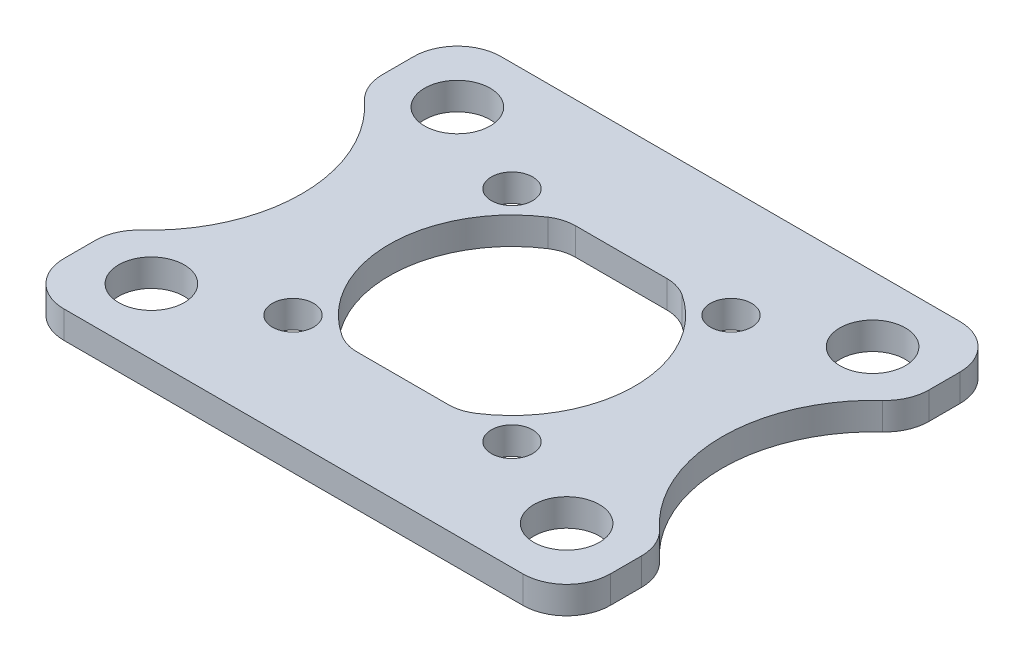
ISO-10303-21;
HEADER;
FILE_DESCRIPTION(('STEP AP214'),'2;1');
FILE_NAME('part.step','',(''),(''),'','','');
FILE_SCHEMA(('AUTOMOTIVE_DESIGN { 1 0 10303 214 1 1 1 1 }'));
ENDSEC;
DATA;
#1=APPLICATION_CONTEXT('core data for automotive mechanical design processes');
#2=APPLICATION_PROTOCOL_DEFINITION('international standard','automotive_design',2000,#1);
#3=PRODUCT_CONTEXT('',#1,'mechanical');
#4=PRODUCT('Part','Part','',(#3));
#5=PRODUCT_RELATED_PRODUCT_CATEGORY('part','',(#4));
#6=PRODUCT_DEFINITION_FORMATION('','',#4);
#7=PRODUCT_DEFINITION_CONTEXT('part definition',#1,'design');
#8=PRODUCT_DEFINITION('design','',#6,#7);
#9=PRODUCT_DEFINITION_SHAPE('','',#8);
#10=(LENGTH_UNIT() NAMED_UNIT(*) SI_UNIT(.MILLI.,.METRE.));
#11=(NAMED_UNIT(*) PLANE_ANGLE_UNIT() SI_UNIT($,.RADIAN.));
#12=(NAMED_UNIT(*) SI_UNIT($,.STERADIAN.) SOLID_ANGLE_UNIT());
#13=UNCERTAINTY_MEASURE_WITH_UNIT(LENGTH_MEASURE(1.E-05),#10,'distance_accuracy_value','');
#14=(GEOMETRIC_REPRESENTATION_CONTEXT(3) GLOBAL_UNCERTAINTY_ASSIGNED_CONTEXT((#13)) GLOBAL_UNIT_ASSIGNED_CONTEXT((#10,
#11,#12)) REPRESENTATION_CONTEXT('',''));
#15=CARTESIAN_POINT('',(0.,0.,0.));
#16=DIRECTION('',(0.,0.,1.));
#17=DIRECTION('',(1.,0.,0.));
#18=AXIS2_PLACEMENT_3D('',#15,#16,#17);
#19=CARTESIAN_POINT('',(15.875,1.5875,12.7));
#20=DIRECTION('',(-1.,0.,0.));
#21=DIRECTION('',(0.,0.,1.));
#22=AXIS2_PLACEMENT_3D('',#19,#20,#21);
#23=PLANE('',#22);
#24=DIRECTION('',(0.,0.,-1.));
#25=VECTOR('',#24,1.);
#26=CARTESIAN_POINT('',(15.875,0.,12.7));
#27=LINE('',#26,#25);
#28=CARTESIAN_POINT('',(15.875,0.,-8.35115536916897));
#29=VERTEX_POINT('',#28);
#30=CARTESIAN_POINT('',(15.875,0.,-10.16));
#31=VERTEX_POINT('',#30);
#32=EDGE_CURVE('E320',#29,#31,#27,.T.);
#33=ORIENTED_EDGE('',*,*,#32,.T.);
#34=DIRECTION('',(0.,-1.,0.));
#35=VECTOR('',#34,1.);
#36=CARTESIAN_POINT('',(15.875,1.5875,-10.16));
#37=LINE('',#36,#35);
#38=CARTESIAN_POINT('',(15.875,1.5875,-10.16));
#39=VERTEX_POINT('',#38);
#40=EDGE_CURVE('E369',#31,#39,#37,.F.);
#41=ORIENTED_EDGE('',*,*,#40,.T.);
#42=DIRECTION('',(0.,0.,-1.));
#43=VECTOR('',#42,1.);
#44=CARTESIAN_POINT('',(15.875,1.5875,12.7));
#45=LINE('',#44,#43);
#46=CARTESIAN_POINT('',(15.875,1.5875,-8.35115536916897));
#47=VERTEX_POINT('',#46);
#48=EDGE_CURVE('E301',#47,#39,#45,.T.);
#49=ORIENTED_EDGE('',*,*,#48,.F.);
#50=DIRECTION('',(0.,-1.,0.));
#51=VECTOR('',#50,1.);
#52=CARTESIAN_POINT('',(15.875,1.5875,-8.35115536916897));
#53=LINE('',#52,#51);
#54=EDGE_CURVE('E366',#47,#29,#53,.T.);
#55=ORIENTED_EDGE('',*,*,#54,.T.);
#56=EDGE_LOOP('',(#33,#41,#49,#55));
#57=FACE_BOUND('',#56,.T.);
#58=ADVANCED_FACE('F36',(#57),#23,.F.);
#59=CARTESIAN_POINT('',(-15.875,1.5875,12.7));
#60=DIRECTION('',(1.,0.,0.));
#61=DIRECTION('',(0.,0.,-1.));
#62=AXIS2_PLACEMENT_3D('',#59,#60,#61);
#63=PLANE('',#62);
#64=DIRECTION('',(0.,0.,1.));
#65=VECTOR('',#64,1.);
#66=CARTESIAN_POINT('',(-15.875,0.,12.7));
#67=LINE('',#66,#65);
#68=CARTESIAN_POINT('',(-15.875,0.,8.35115536916898));
#69=VERTEX_POINT('',#68);
#70=CARTESIAN_POINT('',(-15.875,0.,10.16));
#71=VERTEX_POINT('',#70);
#72=EDGE_CURVE('E323',#69,#71,#67,.T.);
#73=ORIENTED_EDGE('',*,*,#72,.T.);
#74=DIRECTION('',(0.,-1.,0.));
#75=VECTOR('',#74,1.);
#76=CARTESIAN_POINT('',(-15.875,1.5875,10.16));
#77=LINE('',#76,#75);
#78=CARTESIAN_POINT('',(-15.875,1.5875,10.16));
#79=VERTEX_POINT('',#78);
#80=EDGE_CURVE('E389',#71,#79,#77,.F.);
#81=ORIENTED_EDGE('',*,*,#80,.T.);
#82=DIRECTION('',(0.,0.,1.));
#83=VECTOR('',#82,1.);
#84=CARTESIAN_POINT('',(-15.875,1.5875,12.7));
#85=LINE('',#84,#83);
#86=CARTESIAN_POINT('',(-15.875,1.5875,8.35115536916898));
#87=VERTEX_POINT('',#86);
#88=EDGE_CURVE('E309',#87,#79,#85,.T.);
#89=ORIENTED_EDGE('',*,*,#88,.F.);
#90=DIRECTION('',(0.,-1.,0.));
#91=VECTOR('',#90,1.);
#92=CARTESIAN_POINT('',(-15.875,1.5875,8.35115536916898));
#93=LINE('',#92,#91);
#94=EDGE_CURVE('E386',#87,#69,#93,.T.);
#95=ORIENTED_EDGE('',*,*,#94,.T.);
#96=EDGE_LOOP('',(#73,#81,#89,#95));
#97=FACE_BOUND('',#96,.T.);
#98=ADVANCED_FACE('F482',(#97),#63,.F.);
#99=CARTESIAN_POINT('',(0.,1.5875,0.));
#100=DIRECTION('',(0.,-1.,0.));
#101=DIRECTION('',(0.,0.,-1.));
#102=AXIS2_PLACEMENT_3D('',#99,#100,#101);
#103=CYLINDRICAL_SURFACE('',#102,7.1374);
#104=CARTESIAN_POINT('',(0.,1.5875,0.));
#105=DIRECTION('',(0.,1.,0.));
#106=DIRECTION('',(0.,0.,1.));
#107=AXIS2_PLACEMENT_3D('',#104,#105,#106);
#108=CIRCLE('',#107,7.1374);
#109=CARTESIAN_POINT('',(3.89799317546401,1.5875,5.97897382198952));
#110=VERTEX_POINT('',#109);
#111=CARTESIAN_POINT('',(3.89799317546401,1.5875,-5.97897382198953));
#112=VERTEX_POINT('',#111);
#113=EDGE_CURVE('E294',#110,#112,#108,.T.);
#114=ORIENTED_EDGE('',*,*,#113,.T.);
#115=DIRECTION('',(0.,-1.,0.));
#116=VECTOR('',#115,1.);
#117=CARTESIAN_POINT('',(3.89799317546401,1.5875,-5.97897382198953));
#118=LINE('',#117,#116);
#119=CARTESIAN_POINT('',(3.89799317546401,0.,-5.97897382198953));
#120=VERTEX_POINT('',#119);
#121=EDGE_CURVE('E404',#112,#120,#118,.T.);
#122=ORIENTED_EDGE('',*,*,#121,.T.);
#123=CARTESIAN_POINT('',(0.,0.,0.));
#124=DIRECTION('',(0.,1.,0.));
#125=DIRECTION('',(0.,0.,1.));
#126=AXIS2_PLACEMENT_3D('',#123,#124,#125);
#127=CIRCLE('',#126,7.1374);
#128=CARTESIAN_POINT('',(3.89799317546401,0.,5.97897382198952));
#129=VERTEX_POINT('',#128);
#130=EDGE_CURVE('E291',#129,#120,#127,.T.);
#131=ORIENTED_EDGE('',*,*,#130,.F.);
#132=DIRECTION('',(0.,-1.,0.));
#133=VECTOR('',#132,1.);
#134=CARTESIAN_POINT('',(3.89799317546401,1.5875,5.97897382198952));
#135=LINE('',#134,#133);
#136=EDGE_CURVE('E401',#129,#110,#135,.F.);
#137=ORIENTED_EDGE('',*,*,#136,.T.);
#138=EDGE_LOOP('',(#114,#122,#131,#137));
#139=FACE_BOUND('',#138,.T.);
#140=ADVANCED_FACE('F435',(#139),#103,.F.);
#141=CARTESIAN_POINT('',(0.,1.5875,0.));
#142=DIRECTION('',(0.,-1.,0.));
#143=DIRECTION('',(0.,0.,-1.));
#144=AXIS2_PLACEMENT_3D('',#141,#142,#143);
#145=PLANE('',#144);
#146=CARTESIAN_POINT('',(-15.875,1.5875,-10.16));
#147=VERTEX_POINT('',#146);
#148=CARTESIAN_POINT('',(-15.875,1.5875,-8.35115536916898));
#149=VERTEX_POINT('',#148);
#150=EDGE_CURVE('E312',#147,#149,#85,.T.);
#151=ORIENTED_EDGE('',*,*,#150,.T.);
#152=CARTESIAN_POINT('',(-13.335,1.5875,-8.35115536916898));
#153=DIRECTION('',(0.,-1.,0.));
#154=DIRECTION('',(0.,0.,-1.));
#155=AXIS2_PLACEMENT_3D('',#152,#153,#154);
#156=CIRCLE('',#155,2.54);
#157=CARTESIAN_POINT('',(-15.0573800801018,1.5875,-6.48433806164572));
#158=VERTEX_POINT('',#157);
#159=EDGE_CURVE('E359',#149,#158,#156,.F.);
#160=ORIENTED_EDGE('',*,*,#159,.T.);
#161=CARTESIAN_POINT('',(-21.0400194444444,1.5875,0.));
#162=DIRECTION('',(0.,-1.,0.));
#163=DIRECTION('',(0.,0.,1.));
#164=AXIS2_PLACEMENT_3D('',#161,#162,#163);
#165=CIRCLE('',#164,8.82261944444441);
#166=CARTESIAN_POINT('',(-15.0573800801018,1.5875,6.48433806164572));
#167=VERTEX_POINT('',#166);
#168=EDGE_CURVE('E218',#158,#167,#165,.T.);
#169=ORIENTED_EDGE('',*,*,#168,.T.);
#170=CARTESIAN_POINT('',(-13.335,1.5875,8.35115536916898));
#171=DIRECTION('',(0.,-1.,0.));
#172=DIRECTION('',(0.,0.,-1.));
#173=AXIS2_PLACEMENT_3D('',#170,#171,#172);
#174=CIRCLE('',#173,2.54);
#175=EDGE_CURVE('E345',#167,#87,#174,.F.);
#176=ORIENTED_EDGE('',*,*,#175,.T.);
#177=ORIENTED_EDGE('',*,*,#88,.T.);
#178=CARTESIAN_POINT('',(-13.335,1.5875,10.16));
#179=DIRECTION('',(0.,-1.,0.));
#180=DIRECTION('',(0.,0.,-1.));
#181=AXIS2_PLACEMENT_3D('',#178,#179,#180);
#182=CIRCLE('',#181,2.54);
#183=CARTESIAN_POINT('',(-13.335,1.5875,12.7));
#184=VERTEX_POINT('',#183);
#185=EDGE_CURVE('E347',#79,#184,#182,.F.);
#186=ORIENTED_EDGE('',*,*,#185,.T.);
#187=DIRECTION('',(1.,0.,0.));
#188=VECTOR('',#187,1.);
#189=CARTESIAN_POINT('',(-15.875,1.5875,12.7));
#190=LINE('',#189,#188);
#191=CARTESIAN_POINT('',(13.335,1.5875,12.7));
#192=VERTEX_POINT('',#191);
#193=EDGE_CURVE('E313',#184,#192,#190,.T.);
#194=ORIENTED_EDGE('',*,*,#193,.T.);
#195=CARTESIAN_POINT('',(13.335,1.5875,10.16));
#196=DIRECTION('',(0.,-1.,0.));
#197=DIRECTION('',(0.,0.,-1.));
#198=AXIS2_PLACEMENT_3D('',#195,#196,#197);
#199=CIRCLE('',#198,2.54);
#200=CARTESIAN_POINT('',(15.875,1.5875,10.16));
#201=VERTEX_POINT('',#200);
#202=EDGE_CURVE('E349',#192,#201,#199,.F.);
#203=ORIENTED_EDGE('',*,*,#202,.T.);
#204=CARTESIAN_POINT('',(15.875,1.5875,8.35115536916898));
#205=VERTEX_POINT('',#204);
#206=EDGE_CURVE('E304',#201,#205,#45,.T.);
#207=ORIENTED_EDGE('',*,*,#206,.T.);
#208=CARTESIAN_POINT('',(13.335,1.5875,8.35115536916898));
#209=DIRECTION('',(0.,-1.,0.));
#210=DIRECTION('',(0.,0.,-1.));
#211=AXIS2_PLACEMENT_3D('',#208,#209,#210);
#212=CIRCLE('',#211,2.54);
#213=CARTESIAN_POINT('',(15.0573800801018,1.5875,6.48433806164571));
#214=VERTEX_POINT('',#213);
#215=EDGE_CURVE('E351',#205,#214,#212,.F.);
#216=ORIENTED_EDGE('',*,*,#215,.T.);
#217=CARTESIAN_POINT('',(21.0400194444444,1.5875,0.));
#218=DIRECTION('',(0.,-1.,0.));
#219=DIRECTION('',(0.,0.,-1.));
#220=AXIS2_PLACEMENT_3D('',#217,#218,#219);
#221=CIRCLE('',#220,8.82261944444441);
#222=CARTESIAN_POINT('',(15.0573800801018,1.5875,-6.48433806164571));
#223=VERTEX_POINT('',#222);
#224=EDGE_CURVE('E225',#214,#223,#221,.T.);
#225=ORIENTED_EDGE('',*,*,#224,.T.);
#226=CARTESIAN_POINT('',(13.335,1.5875,-8.35115536916898));
#227=DIRECTION('',(0.,-1.,0.));
#228=DIRECTION('',(0.,0.,-1.));
#229=AXIS2_PLACEMENT_3D('',#226,#227,#228);
#230=CIRCLE('',#229,2.54);
#231=EDGE_CURVE('E353',#223,#47,#230,.F.);
#232=ORIENTED_EDGE('',*,*,#231,.T.);
#233=ORIENTED_EDGE('',*,*,#48,.T.);
#234=CARTESIAN_POINT('',(13.335,1.5875,-10.16));
#235=DIRECTION('',(0.,-1.,0.));
#236=DIRECTION('',(0.,0.,-1.));
#237=AXIS2_PLACEMENT_3D('',#234,#235,#236);
#238=CIRCLE('',#237,2.54);
#239=CARTESIAN_POINT('',(13.335,1.5875,-12.7));
#240=VERTEX_POINT('',#239);
#241=EDGE_CURVE('E355',#39,#240,#238,.F.);
#242=ORIENTED_EDGE('',*,*,#241,.T.);
#243=DIRECTION('',(-1.,0.,0.));
#244=VECTOR('',#243,1.);
#245=CARTESIAN_POINT('',(-15.875,1.5875,-12.7));
#246=LINE('',#245,#244);
#247=CARTESIAN_POINT('',(-13.335,1.5875,-12.7));
#248=VERTEX_POINT('',#247);
#249=EDGE_CURVE('E306',#240,#248,#246,.T.);
#250=ORIENTED_EDGE('',*,*,#249,.T.);
#251=CARTESIAN_POINT('',(-13.335,1.5875,-10.16));
#252=DIRECTION('',(0.,-1.,0.));
#253=DIRECTION('',(0.,0.,-1.));
#254=AXIS2_PLACEMENT_3D('',#251,#252,#253);
#255=CIRCLE('',#254,2.54);
#256=EDGE_CURVE('E357',#248,#147,#255,.F.);
#257=ORIENTED_EDGE('',*,*,#256,.T.);
#258=EDGE_LOOP('',(#151,#160,#169,#176,#177,#186,#194,#203,#207,#216,#225,#232,#233,#242,#250,#257));
#259=FACE_BOUND('',#258,.T.);
#260=CARTESIAN_POINT('',(-3.89799317546399,1.5875,-5.97897382198953));
#261=VERTEX_POINT('',#260);
#262=CARTESIAN_POINT('',(-3.89799317546399,1.5875,5.97897382198952));
#263=VERTEX_POINT('',#262);
#264=EDGE_CURVE('E297',#261,#263,#108,.T.);
#265=ORIENTED_EDGE('',*,*,#264,.F.);
#266=CARTESIAN_POINT('',(-2.64952561036876,1.5875,-4.06400000000001));
#267=DIRECTION('',(0.,-1.,0.));
#268=DIRECTION('',(0.,0.,-1.));
#269=AXIS2_PLACEMENT_3D('',#266,#267,#268);
#270=CIRCLE('',#269,2.286);
#271=CARTESIAN_POINT('',(-2.64952561036876,1.5875,-6.35));
#272=VERTEX_POINT('',#271);
#273=EDGE_CURVE('E410',#261,#272,#270,.T.);
#274=ORIENTED_EDGE('',*,*,#273,.T.);
#275=DIRECTION('',(1.,0.,0.));
#276=VECTOR('',#275,1.);
#277=CARTESIAN_POINT('',(-3.25883088852428,1.5875,-6.35));
#278=LINE('',#277,#276);
#279=CARTESIAN_POINT('',(2.64952561036878,1.5875,-6.35));
#280=VERTEX_POINT('',#279);
#281=EDGE_CURVE('E237',#272,#280,#278,.T.);
#282=ORIENTED_EDGE('',*,*,#281,.T.);
#283=CARTESIAN_POINT('',(2.64952561036878,1.5875,-4.06400000000001));
#284=DIRECTION('',(0.,-1.,0.));
#285=DIRECTION('',(0.,0.,-1.));
#286=AXIS2_PLACEMENT_3D('',#283,#284,#285);
#287=CIRCLE('',#286,2.286);
#288=EDGE_CURVE('E414',#280,#112,#287,.T.);
#289=ORIENTED_EDGE('',*,*,#288,.T.);
#290=ORIENTED_EDGE('',*,*,#113,.F.);
#291=CARTESIAN_POINT('',(2.64952561036878,1.5875,4.06399999999999));
#292=DIRECTION('',(0.,-1.,0.));
#293=DIRECTION('',(0.,0.,-1.));
#294=AXIS2_PLACEMENT_3D('',#291,#292,#293);
#295=CIRCLE('',#294,2.286);
#296=CARTESIAN_POINT('',(2.64952561036878,1.5875,6.34999999999999));
#297=VERTEX_POINT('',#296);
#298=EDGE_CURVE('E44',#110,#297,#295,.T.);
#299=ORIENTED_EDGE('',*,*,#298,.T.);
#300=DIRECTION('',(-1.,0.,0.));
#301=VECTOR('',#300,1.);
#302=CARTESIAN_POINT('',(3.25883088852428,1.5875,6.34999999999999));
#303=LINE('',#302,#301);
#304=CARTESIAN_POINT('',(-2.64952561036876,1.5875,6.34999999999999));
#305=VERTEX_POINT('',#304);
#306=EDGE_CURVE('E227',#297,#305,#303,.T.);
#307=ORIENTED_EDGE('',*,*,#306,.T.);
#308=CARTESIAN_POINT('',(-2.64952561036876,1.5875,4.06399999999999));
#309=DIRECTION('',(0.,-1.,0.));
#310=DIRECTION('',(0.,0.,-1.));
#311=AXIS2_PLACEMENT_3D('',#308,#309,#310);
#312=CIRCLE('',#311,2.286);
#313=EDGE_CURVE('E418',#305,#263,#312,.T.);
#314=ORIENTED_EDGE('',*,*,#313,.T.);
#315=EDGE_LOOP('',(#265,#274,#282,#289,#290,#299,#307,#314));
#316=FACE_BOUND('',#315,.T.);
#317=CARTESIAN_POINT('',(-6.36396103067893,1.5875,6.36396103067893));
#318=DIRECTION('',(0.,1.,0.));
#319=DIRECTION('',(0.,0.,1.));
#320=AXIS2_PLACEMENT_3D('',#317,#318,#319);
#321=CIRCLE('',#320,1.2);
#322=CARTESIAN_POINT('',(-6.36396103067893,1.5875,7.56396103067893));
#323=VERTEX_POINT('',#322);
#324=EDGE_CURVE('E288',#323,#323,#321,.T.);
#325=ORIENTED_EDGE('',*,*,#324,.F.);
#326=EDGE_LOOP('',(#325));
#327=FACE_BOUND('',#326,.T.);
#328=CARTESIAN_POINT('',(-6.36396103067893,1.5875,-6.36396103067893));
#329=DIRECTION('',(0.,1.,0.));
#330=DIRECTION('',(0.,0.,1.));
#331=AXIS2_PLACEMENT_3D('',#328,#329,#330);
#332=CIRCLE('',#331,1.2);
#333=CARTESIAN_POINT('',(-6.36396103067893,1.5875,-5.16396103067893));
#334=VERTEX_POINT('',#333);
#335=EDGE_CURVE('E282',#334,#334,#332,.T.);
#336=ORIENTED_EDGE('',*,*,#335,.F.);
#337=EDGE_LOOP('',(#336));
#338=FACE_BOUND('',#337,.T.);
#339=CARTESIAN_POINT('',(6.36396103067893,1.5875,-6.36396103067893));
#340=DIRECTION('',(0.,1.,0.));
#341=DIRECTION('',(0.,0.,1.));
#342=AXIS2_PLACEMENT_3D('',#339,#340,#341);
#343=CIRCLE('',#342,1.2);
#344=CARTESIAN_POINT('',(6.36396103067893,1.5875,-5.16396103067893));
#345=VERTEX_POINT('',#344);
#346=EDGE_CURVE('E276',#345,#345,#343,.T.);
#347=ORIENTED_EDGE('',*,*,#346,.F.);
#348=EDGE_LOOP('',(#347));
#349=FACE_BOUND('',#348,.T.);
#350=CARTESIAN_POINT('',(6.36396103067893,1.5875,6.36396103067893));
#351=DIRECTION('',(0.,1.,0.));
#352=DIRECTION('',(0.,0.,1.));
#353=AXIS2_PLACEMENT_3D('',#350,#351,#352);
#354=CIRCLE('',#353,1.2);
#355=CARTESIAN_POINT('',(6.36396103067893,1.5875,7.56396103067893));
#356=VERTEX_POINT('',#355);
#357=EDGE_CURVE('E270',#356,#356,#354,.T.);
#358=ORIENTED_EDGE('',*,*,#357,.F.);
#359=EDGE_LOOP('',(#358));
#360=FACE_BOUND('',#359,.T.);
#361=CARTESIAN_POINT('',(-12.065,1.5875,8.89));
#362=DIRECTION('',(0.,1.,0.));
#363=DIRECTION('',(0.,0.,1.));
#364=AXIS2_PLACEMENT_3D('',#361,#362,#363);
#365=CIRCLE('',#364,1.905);
#366=CARTESIAN_POINT('',(-12.065,1.5875,10.795));
#367=VERTEX_POINT('',#366);
#368=EDGE_CURVE('E264',#367,#367,#365,.T.);
#369=ORIENTED_EDGE('',*,*,#368,.F.);
#370=EDGE_LOOP('',(#369));
#371=FACE_BOUND('',#370,.T.);
#372=CARTESIAN_POINT('',(-12.065,1.5875,-8.89));
#373=DIRECTION('',(0.,1.,0.));
#374=DIRECTION('',(0.,0.,1.));
#375=AXIS2_PLACEMENT_3D('',#372,#373,#374);
#376=CIRCLE('',#375,1.905);
#377=CARTESIAN_POINT('',(-12.065,1.5875,-6.98499999999999));
#378=VERTEX_POINT('',#377);
#379=EDGE_CURVE('E258',#378,#378,#376,.T.);
#380=ORIENTED_EDGE('',*,*,#379,.F.);
#381=EDGE_LOOP('',(#380));
#382=FACE_BOUND('',#381,.T.);
#383=CARTESIAN_POINT('',(12.065,1.5875,-8.89));
#384=DIRECTION('',(0.,1.,0.));
#385=DIRECTION('',(0.,0.,1.));
#386=AXIS2_PLACEMENT_3D('',#383,#384,#385);
#387=CIRCLE('',#386,1.905);
#388=CARTESIAN_POINT('',(12.065,1.5875,-6.98499999999999));
#389=VERTEX_POINT('',#388);
#390=EDGE_CURVE('E252',#389,#389,#387,.T.);
#391=ORIENTED_EDGE('',*,*,#390,.F.);
#392=EDGE_LOOP('',(#391));
#393=FACE_BOUND('',#392,.T.);
#394=CARTESIAN_POINT('',(12.065,1.5875,8.89));
#395=DIRECTION('',(0.,1.,0.));
#396=DIRECTION('',(0.,0.,1.));
#397=AXIS2_PLACEMENT_3D('',#394,#395,#396);
#398=CIRCLE('',#397,1.905);
#399=CARTESIAN_POINT('',(12.065,1.5875,10.795));
#400=VERTEX_POINT('',#399);
#401=EDGE_CURVE('E246',#400,#400,#398,.T.);
#402=ORIENTED_EDGE('',*,*,#401,.F.);
#403=EDGE_LOOP('',(#402));
#404=FACE_BOUND('',#403,.T.);
#405=ADVANCED_FACE('F423',(#259,#316,#327,#338,#349,#360,#371,#382,#393,#404),#145,.F.);
#406=CARTESIAN_POINT('',(0.,0.,0.));
#407=DIRECTION('',(0.,-1.,0.));
#408=DIRECTION('',(0.,0.,-1.));
#409=AXIS2_PLACEMENT_3D('',#406,#407,#408);
#410=PLANE('',#409);
#411=CARTESIAN_POINT('',(-21.0400194444444,0.,0.));
#412=DIRECTION('',(0.,-1.,0.));
#413=DIRECTION('',(0.,0.,1.));
#414=AXIS2_PLACEMENT_3D('',#411,#412,#413);
#415=CIRCLE('',#414,8.82261944444441);
#416=CARTESIAN_POINT('',(-15.0573800801018,0.,-6.48433806164572));
#417=VERTEX_POINT('',#416);
#418=CARTESIAN_POINT('',(-15.0573800801018,0.,6.48433806164572));
#419=VERTEX_POINT('',#418);
#420=EDGE_CURVE('E215',#417,#419,#415,.T.);
#421=ORIENTED_EDGE('',*,*,#420,.F.);
#422=CARTESIAN_POINT('',(-13.335,0.,-8.35115536916898));
#423=DIRECTION('',(0.,-1.,0.));
#424=DIRECTION('',(0.,0.,-1.));
#425=AXIS2_PLACEMENT_3D('',#422,#423,#424);
#426=CIRCLE('',#425,2.54);
#427=CARTESIAN_POINT('',(-15.875,0.,-8.35115536916898));
#428=VERTEX_POINT('',#427);
#429=EDGE_CURVE('E198',#417,#428,#426,.T.);
#430=ORIENTED_EDGE('',*,*,#429,.T.);
#431=CARTESIAN_POINT('',(-15.875,0.,-10.16));
#432=VERTEX_POINT('',#431);
#433=EDGE_CURVE('E326',#432,#428,#67,.T.);
#434=ORIENTED_EDGE('',*,*,#433,.F.);
#435=CARTESIAN_POINT('',(-13.335,0.,-10.16));
#436=DIRECTION('',(0.,-1.,0.));
#437=DIRECTION('',(0.,0.,-1.));
#438=AXIS2_PLACEMENT_3D('',#435,#436,#437);
#439=CIRCLE('',#438,2.54);
#440=CARTESIAN_POINT('',(-13.335,0.,-12.7));
#441=VERTEX_POINT('',#440);
#442=EDGE_CURVE('E209',#432,#441,#439,.T.);
#443=ORIENTED_EDGE('',*,*,#442,.T.);
#444=DIRECTION('',(-1.,0.,0.));
#445=VECTOR('',#444,1.);
#446=CARTESIAN_POINT('',(-15.875,0.,-12.7));
#447=LINE('',#446,#445);
#448=CARTESIAN_POINT('',(13.335,0.,-12.7));
#449=VERTEX_POINT('',#448);
#450=EDGE_CURVE('E319',#449,#441,#447,.T.);
#451=ORIENTED_EDGE('',*,*,#450,.F.);
#452=CARTESIAN_POINT('',(13.335,0.,-10.16));
#453=DIRECTION('',(0.,-1.,0.));
#454=DIRECTION('',(0.,0.,-1.));
#455=AXIS2_PLACEMENT_3D('',#452,#453,#454);
#456=CIRCLE('',#455,2.54);
#457=EDGE_CURVE('E339',#449,#31,#456,.T.);
#458=ORIENTED_EDGE('',*,*,#457,.T.);
#459=ORIENTED_EDGE('',*,*,#32,.F.);
#460=CARTESIAN_POINT('',(13.335,0.,-8.35115536916898));
#461=DIRECTION('',(0.,-1.,0.));
#462=DIRECTION('',(0.,0.,-1.));
#463=AXIS2_PLACEMENT_3D('',#460,#461,#462);
#464=CIRCLE('',#463,2.54);
#465=CARTESIAN_POINT('',(15.0573800801018,0.,-6.48433806164571));
#466=VERTEX_POINT('',#465);
#467=EDGE_CURVE('E337',#29,#466,#464,.T.);
#468=ORIENTED_EDGE('',*,*,#467,.T.);
#469=CARTESIAN_POINT('',(21.0400194444444,0.,0.));
#470=DIRECTION('',(0.,-1.,0.));
#471=DIRECTION('',(0.,0.,-1.));
#472=AXIS2_PLACEMENT_3D('',#469,#470,#471);
#473=CIRCLE('',#472,8.82261944444441);
#474=CARTESIAN_POINT('',(15.0573800801018,0.,6.48433806164571));
#475=VERTEX_POINT('',#474);
#476=EDGE_CURVE('E230',#475,#466,#473,.T.);
#477=ORIENTED_EDGE('',*,*,#476,.F.);
#478=CARTESIAN_POINT('',(13.335,0.,8.35115536916898));
#479=DIRECTION('',(0.,-1.,0.));
#480=DIRECTION('',(0.,0.,-1.));
#481=AXIS2_PLACEMENT_3D('',#478,#479,#480);
#482=CIRCLE('',#481,2.54);
#483=CARTESIAN_POINT('',(15.875,0.,8.35115536916898));
#484=VERTEX_POINT('',#483);
#485=EDGE_CURVE('E335',#475,#484,#482,.T.);
#486=ORIENTED_EDGE('',*,*,#485,.T.);
#487=CARTESIAN_POINT('',(15.875,0.,10.16));
#488=VERTEX_POINT('',#487);
#489=EDGE_CURVE('E316',#488,#484,#27,.T.);
#490=ORIENTED_EDGE('',*,*,#489,.F.);
#491=CARTESIAN_POINT('',(13.335,0.,10.16));
#492=DIRECTION('',(0.,-1.,0.));
#493=DIRECTION('',(0.,0.,-1.));
#494=AXIS2_PLACEMENT_3D('',#491,#492,#493);
#495=CIRCLE('',#494,2.54);
#496=CARTESIAN_POINT('',(13.335,0.,12.7));
#497=VERTEX_POINT('',#496);
#498=EDGE_CURVE('E333',#488,#497,#495,.T.);
#499=ORIENTED_EDGE('',*,*,#498,.T.);
#500=DIRECTION('',(1.,0.,0.));
#501=VECTOR('',#500,1.);
#502=CARTESIAN_POINT('',(-15.875,0.,12.7));
#503=LINE('',#502,#501);
#504=CARTESIAN_POINT('',(-13.335,0.,12.7));
#505=VERTEX_POINT('',#504);
#506=EDGE_CURVE('E305',#505,#497,#503,.T.);
#507=ORIENTED_EDGE('',*,*,#506,.F.);
#508=CARTESIAN_POINT('',(-13.335,0.,10.16));
#509=DIRECTION('',(0.,-1.,0.));
#510=DIRECTION('',(0.,0.,-1.));
#511=AXIS2_PLACEMENT_3D('',#508,#509,#510);
#512=CIRCLE('',#511,2.54);
#513=EDGE_CURVE('E331',#505,#71,#512,.T.);
#514=ORIENTED_EDGE('',*,*,#513,.T.);
#515=ORIENTED_EDGE('',*,*,#72,.F.);
#516=CARTESIAN_POINT('',(-13.335,0.,8.35115536916898));
#517=DIRECTION('',(0.,-1.,0.));
#518=DIRECTION('',(0.,0.,-1.));
#519=AXIS2_PLACEMENT_3D('',#516,#517,#518);
#520=CIRCLE('',#519,2.54);
#521=EDGE_CURVE('E219',#69,#419,#520,.T.);
#522=ORIENTED_EDGE('',*,*,#521,.T.);
#523=EDGE_LOOP('',(#421,#430,#434,#443,#451,#458,#459,#468,#477,#486,#490,#499,#507,#514,#515,#522));
#524=FACE_BOUND('',#523,.T.);
#525=CARTESIAN_POINT('',(12.065,0.,-8.89));
#526=DIRECTION('',(0.,1.,0.));
#527=DIRECTION('',(0.,0.,1.));
#528=AXIS2_PLACEMENT_3D('',#525,#526,#527);
#529=CIRCLE('',#528,1.905);
#530=CARTESIAN_POINT('',(12.065,0.,-6.98499999999999));
#531=VERTEX_POINT('',#530);
#532=EDGE_CURVE('E249',#531,#531,#529,.T.);
#533=ORIENTED_EDGE('',*,*,#532,.T.);
#534=EDGE_LOOP('',(#533));
#535=FACE_BOUND('',#534,.T.);
#536=CARTESIAN_POINT('',(-12.065,0.,8.89));
#537=DIRECTION('',(0.,1.,0.));
#538=DIRECTION('',(0.,0.,1.));
#539=AXIS2_PLACEMENT_3D('',#536,#537,#538);
#540=CIRCLE('',#539,1.905);
#541=CARTESIAN_POINT('',(-12.065,0.,10.795));
#542=VERTEX_POINT('',#541);
#543=EDGE_CURVE('E261',#542,#542,#540,.T.);
#544=ORIENTED_EDGE('',*,*,#543,.T.);
#545=EDGE_LOOP('',(#544));
#546=FACE_BOUND('',#545,.T.);
#547=CARTESIAN_POINT('',(6.36396103067893,0.,-6.36396103067893));
#548=DIRECTION('',(0.,1.,0.));
#549=DIRECTION('',(0.,0.,1.));
#550=AXIS2_PLACEMENT_3D('',#547,#548,#549);
#551=CIRCLE('',#550,1.2);
#552=CARTESIAN_POINT('',(6.36396103067893,0.,-5.16396103067893));
#553=VERTEX_POINT('',#552);
#554=EDGE_CURVE('E273',#553,#553,#551,.T.);
#555=ORIENTED_EDGE('',*,*,#554,.T.);
#556=EDGE_LOOP('',(#555));
#557=FACE_BOUND('',#556,.T.);
#558=CARTESIAN_POINT('',(-6.36396103067893,0.,6.36396103067893));
#559=DIRECTION('',(0.,1.,0.));
#560=DIRECTION('',(0.,0.,1.));
#561=AXIS2_PLACEMENT_3D('',#558,#559,#560);
#562=CIRCLE('',#561,1.2);
#563=CARTESIAN_POINT('',(-6.36396103067893,0.,7.56396103067893));
#564=VERTEX_POINT('',#563);
#565=EDGE_CURVE('E285',#564,#564,#562,.T.);
#566=ORIENTED_EDGE('',*,*,#565,.T.);
#567=EDGE_LOOP('',(#566));
#568=FACE_BOUND('',#567,.T.);
#569=DIRECTION('',(1.,0.,0.));
#570=VECTOR('',#569,1.);
#571=CARTESIAN_POINT('',(-3.25883088852428,0.,-6.35));
#572=LINE('',#571,#570);
#573=CARTESIAN_POINT('',(-2.64952561036876,0.,-6.35));
#574=VERTEX_POINT('',#573);
#575=CARTESIAN_POINT('',(2.64952561036878,0.,-6.35));
#576=VERTEX_POINT('',#575);
#577=EDGE_CURVE('E240',#574,#576,#572,.T.);
#578=ORIENTED_EDGE('',*,*,#577,.F.);
#579=CARTESIAN_POINT('',(-2.64952561036876,0.,-4.06400000000001));
#580=DIRECTION('',(0.,-1.,0.));
#581=DIRECTION('',(0.,0.,-1.));
#582=AXIS2_PLACEMENT_3D('',#579,#580,#581);
#583=CIRCLE('',#582,2.286);
#584=CARTESIAN_POINT('',(-3.89799317546399,0.,-5.97897382198953));
#585=VERTEX_POINT('',#584);
#586=EDGE_CURVE('E412',#574,#585,#583,.F.);
#587=ORIENTED_EDGE('',*,*,#586,.T.);
#588=CARTESIAN_POINT('',(-3.89799317546399,0.,5.97897382198952));
#589=VERTEX_POINT('',#588);
#590=EDGE_CURVE('E298',#585,#589,#127,.T.);
#591=ORIENTED_EDGE('',*,*,#590,.T.);
#592=CARTESIAN_POINT('',(-2.64952561036876,0.,4.06399999999999));
#593=DIRECTION('',(0.,-1.,0.));
#594=DIRECTION('',(0.,0.,-1.));
#595=AXIS2_PLACEMENT_3D('',#592,#593,#594);
#596=CIRCLE('',#595,2.286);
#597=CARTESIAN_POINT('',(-2.64952561036876,0.,6.34999999999999));
#598=VERTEX_POINT('',#597);
#599=EDGE_CURVE('E51',#589,#598,#596,.F.);
#600=ORIENTED_EDGE('',*,*,#599,.T.);
#601=DIRECTION('',(-1.,0.,0.));
#602=VECTOR('',#601,1.);
#603=CARTESIAN_POINT('',(3.25883088852428,0.,6.34999999999999));
#604=LINE('',#603,#602);
#605=CARTESIAN_POINT('',(2.64952561036878,0.,6.34999999999999));
#606=VERTEX_POINT('',#605);
#607=EDGE_CURVE('E235',#606,#598,#604,.T.);
#608=ORIENTED_EDGE('',*,*,#607,.F.);
#609=CARTESIAN_POINT('',(2.64952561036878,0.,4.06399999999999));
#610=DIRECTION('',(0.,-1.,0.));
#611=DIRECTION('',(0.,0.,-1.));
#612=AXIS2_PLACEMENT_3D('',#609,#610,#611);
#613=CIRCLE('',#612,2.286);
#614=EDGE_CURVE('E11',#606,#129,#613,.F.);
#615=ORIENTED_EDGE('',*,*,#614,.T.);
#616=ORIENTED_EDGE('',*,*,#130,.T.);
#617=CARTESIAN_POINT('',(2.64952561036878,0.,-4.06400000000001));
#618=DIRECTION('',(0.,-1.,0.));
#619=DIRECTION('',(0.,0.,-1.));
#620=AXIS2_PLACEMENT_3D('',#617,#618,#619);
#621=CIRCLE('',#620,2.286);
#622=EDGE_CURVE('E416',#120,#576,#621,.F.);
#623=ORIENTED_EDGE('',*,*,#622,.T.);
#624=EDGE_LOOP('',(#578,#587,#591,#600,#608,#615,#616,#623));
#625=FACE_BOUND('',#624,.T.);
#626=CARTESIAN_POINT('',(-6.36396103067893,0.,-6.36396103067893));
#627=DIRECTION('',(0.,1.,0.));
#628=DIRECTION('',(0.,0.,1.));
#629=AXIS2_PLACEMENT_3D('',#626,#627,#628);
#630=CIRCLE('',#629,1.2);
#631=CARTESIAN_POINT('',(-6.36396103067893,0.,-5.16396103067893));
#632=VERTEX_POINT('',#631);
#633=EDGE_CURVE('E279',#632,#632,#630,.T.);
#634=ORIENTED_EDGE('',*,*,#633,.T.);
#635=EDGE_LOOP('',(#634));
#636=FACE_BOUND('',#635,.T.);
#637=CARTESIAN_POINT('',(6.36396103067893,0.,6.36396103067893));
#638=DIRECTION('',(0.,1.,0.));
#639=DIRECTION('',(0.,0.,1.));
#640=AXIS2_PLACEMENT_3D('',#637,#638,#639);
#641=CIRCLE('',#640,1.2);
#642=CARTESIAN_POINT('',(6.36396103067893,0.,7.56396103067893));
#643=VERTEX_POINT('',#642);
#644=EDGE_CURVE('E267',#643,#643,#641,.T.);
#645=ORIENTED_EDGE('',*,*,#644,.T.);
#646=EDGE_LOOP('',(#645));
#647=FACE_BOUND('',#646,.T.);
#648=CARTESIAN_POINT('',(-12.065,0.,-8.89));
#649=DIRECTION('',(0.,1.,0.));
#650=DIRECTION('',(0.,0.,1.));
#651=AXIS2_PLACEMENT_3D('',#648,#649,#650);
#652=CIRCLE('',#651,1.905);
#653=CARTESIAN_POINT('',(-12.065,0.,-6.98499999999999));
#654=VERTEX_POINT('',#653);
#655=EDGE_CURVE('E255',#654,#654,#652,.T.);
#656=ORIENTED_EDGE('',*,*,#655,.T.);
#657=EDGE_LOOP('',(#656));
#658=FACE_BOUND('',#657,.T.);
#659=CARTESIAN_POINT('',(12.065,0.,8.89));
#660=DIRECTION('',(0.,1.,0.));
#661=DIRECTION('',(0.,0.,1.));
#662=AXIS2_PLACEMENT_3D('',#659,#660,#661);
#663=CIRCLE('',#662,1.905);
#664=CARTESIAN_POINT('',(12.065,0.,10.795));
#665=VERTEX_POINT('',#664);
#666=EDGE_CURVE('E243',#665,#665,#663,.T.);
#667=ORIENTED_EDGE('',*,*,#666,.T.);
#668=EDGE_LOOP('',(#667));
#669=FACE_BOUND('',#668,.T.);
#670=ADVANCED_FACE('F222',(#524,#535,#546,#557,#568,#625,#636,#647,#658,#669),#410,.T.);
#671=ORIENTED_EDGE('',*,*,#489,.T.);
#672=DIRECTION('',(0.,-1.,0.));
#673=VECTOR('',#672,1.);
#674=CARTESIAN_POINT('',(15.875,1.5875,8.35115536916898));
#675=LINE('',#674,#673);
#676=EDGE_CURVE('E379',#484,#205,#675,.F.);
#677=ORIENTED_EDGE('',*,*,#676,.T.);
#678=ORIENTED_EDGE('',*,*,#206,.F.);
#679=DIRECTION('',(0.,-1.,0.));
#680=VECTOR('',#679,1.);
#681=CARTESIAN_POINT('',(15.875,1.5875,10.16));
#682=LINE('',#681,#680);
#683=EDGE_CURVE('E376',#201,#488,#682,.T.);
#684=ORIENTED_EDGE('',*,*,#683,.T.);
#685=EDGE_LOOP('',(#671,#677,#678,#684));
#686=FACE_BOUND('',#685,.T.);
#687=ADVANCED_FACE('F489',(#686),#23,.F.);
#688=CARTESIAN_POINT('',(-15.875,1.5875,-12.7));
#689=DIRECTION('',(0.,0.,1.));
#690=DIRECTION('',(1.,0.,0.));
#691=AXIS2_PLACEMENT_3D('',#688,#689,#690);
#692=PLANE('',#691);
#693=ORIENTED_EDGE('',*,*,#450,.T.);
#694=DIRECTION('',(0.,-1.,0.));
#695=VECTOR('',#694,1.);
#696=CARTESIAN_POINT('',(-13.335,1.5875,-12.7));
#697=LINE('',#696,#695);
#698=EDGE_CURVE('E364',#441,#248,#697,.F.);
#699=ORIENTED_EDGE('',*,*,#698,.T.);
#700=ORIENTED_EDGE('',*,*,#249,.F.);
#701=DIRECTION('',(0.,-1.,0.));
#702=VECTOR('',#701,1.);
#703=CARTESIAN_POINT('',(13.335,1.5875,-12.7));
#704=LINE('',#703,#702);
#705=EDGE_CURVE('E361',#240,#449,#704,.T.);
#706=ORIENTED_EDGE('',*,*,#705,.T.);
#707=EDGE_LOOP('',(#693,#699,#700,#706));
#708=FACE_BOUND('',#707,.T.);
#709=ADVANCED_FACE('F470',(#708),#692,.F.);
#710=ORIENTED_EDGE('',*,*,#433,.T.);
#711=DIRECTION('',(0.,-1.,0.));
#712=VECTOR('',#711,1.);
#713=CARTESIAN_POINT('',(-15.875,1.5875,-8.35115536916898));
#714=LINE('',#713,#712);
#715=EDGE_CURVE('E203',#428,#149,#714,.F.);
#716=ORIENTED_EDGE('',*,*,#715,.T.);
#717=ORIENTED_EDGE('',*,*,#150,.F.);
#718=DIRECTION('',(0.,-1.,0.));
#719=VECTOR('',#718,1.);
#720=CARTESIAN_POINT('',(-15.875,1.5875,-10.16));
#721=LINE('',#720,#719);
#722=EDGE_CURVE('E208',#147,#432,#721,.T.);
#723=ORIENTED_EDGE('',*,*,#722,.T.);
#724=EDGE_LOOP('',(#710,#716,#717,#723));
#725=FACE_BOUND('',#724,.T.);
#726=ADVANCED_FACE('F478',(#725),#63,.F.);
#727=CARTESIAN_POINT('',(-15.875,1.5875,12.7));
#728=DIRECTION('',(0.,0.,-1.));
#729=DIRECTION('',(-1.,0.,0.));
#730=AXIS2_PLACEMENT_3D('',#727,#728,#729);
#731=PLANE('',#730);
#732=ORIENTED_EDGE('',*,*,#506,.T.);
#733=DIRECTION('',(0.,-1.,0.));
#734=VECTOR('',#733,1.);
#735=CARTESIAN_POINT('',(13.335,1.5875,12.7));
#736=LINE('',#735,#734);
#737=EDGE_CURVE('E384',#497,#192,#736,.F.);
#738=ORIENTED_EDGE('',*,*,#737,.T.);
#739=ORIENTED_EDGE('',*,*,#193,.F.);
#740=DIRECTION('',(0.,-1.,0.));
#741=VECTOR('',#740,1.);
#742=CARTESIAN_POINT('',(-13.335,1.5875,12.7));
#743=LINE('',#742,#741);
#744=EDGE_CURVE('E381',#184,#505,#743,.T.);
#745=ORIENTED_EDGE('',*,*,#744,.T.);
#746=EDGE_LOOP('',(#732,#738,#739,#745));
#747=FACE_BOUND('',#746,.T.);
#748=ADVANCED_FACE('F480',(#747),#731,.F.);
#749=ORIENTED_EDGE('',*,*,#590,.F.);
#750=DIRECTION('',(0.,-1.,0.));
#751=VECTOR('',#750,1.);
#752=CARTESIAN_POINT('',(-3.89799317546399,1.5875,-5.97897382198953));
#753=LINE('',#752,#751);
#754=EDGE_CURVE('E393',#585,#261,#753,.F.);
#755=ORIENTED_EDGE('',*,*,#754,.T.);
#756=ORIENTED_EDGE('',*,*,#264,.T.);
#757=DIRECTION('',(0.,-1.,0.));
#758=VECTOR('',#757,1.);
#759=CARTESIAN_POINT('',(-3.89799317546399,1.5875,5.97897382198952));
#760=LINE('',#759,#758);
#761=EDGE_CURVE('E391',#263,#589,#760,.T.);
#762=ORIENTED_EDGE('',*,*,#761,.T.);
#763=EDGE_LOOP('',(#749,#755,#756,#762));
#764=FACE_BOUND('',#763,.T.);
#765=ADVANCED_FACE('F450',(#764),#103,.F.);
#766=CARTESIAN_POINT('',(-6.36396103067893,1.5875,6.36396103067893));
#767=DIRECTION('',(0.,-1.,0.));
#768=DIRECTION('',(0.,0.,-1.));
#769=AXIS2_PLACEMENT_3D('',#766,#767,#768);
#770=CYLINDRICAL_SURFACE('',#769,1.2);
#771=ORIENTED_EDGE('',*,*,#324,.T.);
#772=EDGE_LOOP('',(#771));
#773=FACE_BOUND('',#772,.T.);
#774=ORIENTED_EDGE('',*,*,#565,.F.);
#775=EDGE_LOOP('',(#774));
#776=FACE_BOUND('',#775,.T.);
#777=ADVANCED_FACE('F599',(#773,#776),#770,.F.);
#778=CARTESIAN_POINT('',(-6.36396103067893,1.5875,-6.36396103067893));
#779=DIRECTION('',(0.,-1.,0.));
#780=DIRECTION('',(0.,0.,-1.));
#781=AXIS2_PLACEMENT_3D('',#778,#779,#780);
#782=CYLINDRICAL_SURFACE('',#781,1.2);
#783=ORIENTED_EDGE('',*,*,#335,.T.);
#784=EDGE_LOOP('',(#783));
#785=FACE_BOUND('',#784,.T.);
#786=ORIENTED_EDGE('',*,*,#633,.F.);
#787=EDGE_LOOP('',(#786));
#788=FACE_BOUND('',#787,.T.);
#789=ADVANCED_FACE('F773',(#785,#788),#782,.F.);
#790=CARTESIAN_POINT('',(6.36396103067893,1.5875,-6.36396103067893));
#791=DIRECTION('',(0.,-1.,0.));
#792=DIRECTION('',(0.,0.,-1.));
#793=AXIS2_PLACEMENT_3D('',#790,#791,#792);
#794=CYLINDRICAL_SURFACE('',#793,1.2);
#795=ORIENTED_EDGE('',*,*,#346,.T.);
#796=EDGE_LOOP('',(#795));
#797=FACE_BOUND('',#796,.T.);
#798=ORIENTED_EDGE('',*,*,#554,.F.);
#799=EDGE_LOOP('',(#798));
#800=FACE_BOUND('',#799,.T.);
#801=ADVANCED_FACE('F763',(#797,#800),#794,.F.);
#802=CARTESIAN_POINT('',(6.36396103067893,1.5875,6.36396103067893));
#803=DIRECTION('',(0.,-1.,0.));
#804=DIRECTION('',(0.,0.,-1.));
#805=AXIS2_PLACEMENT_3D('',#802,#803,#804);
#806=CYLINDRICAL_SURFACE('',#805,1.2);
#807=ORIENTED_EDGE('',*,*,#357,.T.);
#808=EDGE_LOOP('',(#807));
#809=FACE_BOUND('',#808,.T.);
#810=ORIENTED_EDGE('',*,*,#644,.F.);
#811=EDGE_LOOP('',(#810));
#812=FACE_BOUND('',#811,.T.);
#813=ADVANCED_FACE('F753',(#809,#812),#806,.F.);
#814=CARTESIAN_POINT('',(-12.065,1.5875,8.89));
#815=DIRECTION('',(0.,-1.,0.));
#816=DIRECTION('',(0.,0.,-1.));
#817=AXIS2_PLACEMENT_3D('',#814,#815,#816);
#818=CYLINDRICAL_SURFACE('',#817,1.905);
#819=ORIENTED_EDGE('',*,*,#368,.T.);
#820=EDGE_LOOP('',(#819));
#821=FACE_BOUND('',#820,.T.);
#822=ORIENTED_EDGE('',*,*,#543,.F.);
#823=EDGE_LOOP('',(#822));
#824=FACE_BOUND('',#823,.T.);
#825=ADVANCED_FACE('F743',(#821,#824),#818,.F.);
#826=CARTESIAN_POINT('',(-12.065,1.5875,-8.89));
#827=DIRECTION('',(0.,-1.,0.));
#828=DIRECTION('',(0.,0.,-1.));
#829=AXIS2_PLACEMENT_3D('',#826,#827,#828);
#830=CYLINDRICAL_SURFACE('',#829,1.905);
#831=ORIENTED_EDGE('',*,*,#379,.T.);
#832=EDGE_LOOP('',(#831));
#833=FACE_BOUND('',#832,.T.);
#834=ORIENTED_EDGE('',*,*,#655,.F.);
#835=EDGE_LOOP('',(#834));
#836=FACE_BOUND('',#835,.T.);
#837=ADVANCED_FACE('F733',(#833,#836),#830,.F.);
#838=CARTESIAN_POINT('',(12.065,1.5875,-8.89));
#839=DIRECTION('',(0.,-1.,0.));
#840=DIRECTION('',(0.,0.,-1.));
#841=AXIS2_PLACEMENT_3D('',#838,#839,#840);
#842=CYLINDRICAL_SURFACE('',#841,1.905);
#843=ORIENTED_EDGE('',*,*,#390,.T.);
#844=EDGE_LOOP('',(#843));
#845=FACE_BOUND('',#844,.T.);
#846=ORIENTED_EDGE('',*,*,#532,.F.);
#847=EDGE_LOOP('',(#846));
#848=FACE_BOUND('',#847,.T.);
#849=ADVANCED_FACE('F723',(#845,#848),#842,.F.);
#850=CARTESIAN_POINT('',(12.065,1.5875,8.89));
#851=DIRECTION('',(0.,-1.,0.));
#852=DIRECTION('',(0.,0.,-1.));
#853=AXIS2_PLACEMENT_3D('',#850,#851,#852);
#854=CYLINDRICAL_SURFACE('',#853,1.905);
#855=ORIENTED_EDGE('',*,*,#401,.T.);
#856=EDGE_LOOP('',(#855));
#857=FACE_BOUND('',#856,.T.);
#858=ORIENTED_EDGE('',*,*,#666,.F.);
#859=EDGE_LOOP('',(#858));
#860=FACE_BOUND('',#859,.T.);
#861=ADVANCED_FACE('F588',(#857,#860),#854,.F.);
#862=CARTESIAN_POINT('',(-3.25883088852428,0.,-6.35));
#863=DIRECTION('',(0.,0.,1.));
#864=DIRECTION('',(1.,0.,0.));
#865=AXIS2_PLACEMENT_3D('',#862,#863,#864);
#866=PLANE('',#865);
#867=ORIENTED_EDGE('',*,*,#281,.F.);
#868=DIRECTION('',(0.,1.,0.));
#869=VECTOR('',#868,1.);
#870=CARTESIAN_POINT('',(-2.64952561036876,0.,-6.35));
#871=LINE('',#870,#869);
#872=EDGE_CURVE('E399',#272,#574,#871,.F.);
#873=ORIENTED_EDGE('',*,*,#872,.T.);
#874=ORIENTED_EDGE('',*,*,#577,.T.);
#875=DIRECTION('',(0.,1.,0.));
#876=VECTOR('',#875,1.);
#877=CARTESIAN_POINT('',(2.64952561036878,1.5875,-6.35));
#878=LINE('',#877,#876);
#879=EDGE_CURVE('E396',#576,#280,#878,.T.);
#880=ORIENTED_EDGE('',*,*,#879,.T.);
#881=EDGE_LOOP('',(#867,#873,#874,#880));
#882=FACE_BOUND('',#881,.T.);
#883=ADVANCED_FACE('F443',(#882),#866,.T.);
#884=CARTESIAN_POINT('',(3.25883088852428,0.,6.34999999999999));
#885=DIRECTION('',(0.,0.,-1.));
#886=DIRECTION('',(-1.,0.,0.));
#887=AXIS2_PLACEMENT_3D('',#884,#885,#886);
#888=PLANE('',#887);
#889=ORIENTED_EDGE('',*,*,#607,.T.);
#890=DIRECTION('',(0.,1.,0.));
#891=VECTOR('',#890,1.);
#892=CARTESIAN_POINT('',(-2.64952561036876,1.5875,6.34999999999999));
#893=LINE('',#892,#891);
#894=EDGE_CURVE('E407',#598,#305,#893,.T.);
#895=ORIENTED_EDGE('',*,*,#894,.T.);
#896=ORIENTED_EDGE('',*,*,#306,.F.);
#897=DIRECTION('',(0.,1.,0.));
#898=VECTOR('',#897,1.);
#899=CARTESIAN_POINT('',(2.64952561036878,0.,6.34999999999999));
#900=LINE('',#899,#898);
#901=EDGE_CURVE('E58',#297,#606,#900,.F.);
#902=ORIENTED_EDGE('',*,*,#901,.T.);
#903=EDGE_LOOP('',(#889,#895,#896,#902));
#904=FACE_BOUND('',#903,.T.);
#905=ADVANCED_FACE('F427',(#904),#888,.T.);
#906=CARTESIAN_POINT('',(-21.0400194444444,1.5875,0.));
#907=DIRECTION('',(0.,-1.,0.));
#908=DIRECTION('',(0.,0.,-1.));
#909=AXIS2_PLACEMENT_3D('',#906,#907,#908);
#910=CYLINDRICAL_SURFACE('',#909,8.82261944444441);
#911=ORIENTED_EDGE('',*,*,#168,.F.);
#912=DIRECTION('',(0.,-1.,0.));
#913=VECTOR('',#912,1.);
#914=CARTESIAN_POINT('',(-15.0573800801018,1.5875,-6.48433806164572));
#915=LINE('',#914,#913);
#916=EDGE_CURVE('E202',#158,#417,#915,.T.);
#917=ORIENTED_EDGE('',*,*,#916,.T.);
#918=ORIENTED_EDGE('',*,*,#420,.T.);
#919=DIRECTION('',(0.,-1.,0.));
#920=VECTOR('',#919,1.);
#921=CARTESIAN_POINT('',(-15.0573800801018,1.5875,6.48433806164572));
#922=LINE('',#921,#920);
#923=EDGE_CURVE('E220',#419,#167,#922,.F.);
#924=ORIENTED_EDGE('',*,*,#923,.T.);
#925=EDGE_LOOP('',(#911,#917,#918,#924));
#926=FACE_BOUND('',#925,.T.);
#927=ADVANCED_FACE('F214',(#926),#910,.F.);
#928=CARTESIAN_POINT('',(21.0400194444444,1.5875,0.));
#929=DIRECTION('',(0.,-1.,0.));
#930=DIRECTION('',(0.,0.,-1.));
#931=AXIS2_PLACEMENT_3D('',#928,#929,#930);
#932=CYLINDRICAL_SURFACE('',#931,8.82261944444441);
#933=ORIENTED_EDGE('',*,*,#476,.T.);
#934=DIRECTION('',(0.,-1.,0.));
#935=VECTOR('',#934,1.);
#936=CARTESIAN_POINT('',(15.0573800801018,1.5875,-6.48433806164571));
#937=LINE('',#936,#935);
#938=EDGE_CURVE('E374',#466,#223,#937,.F.);
#939=ORIENTED_EDGE('',*,*,#938,.T.);
#940=ORIENTED_EDGE('',*,*,#224,.F.);
#941=DIRECTION('',(0.,-1.,0.));
#942=VECTOR('',#941,1.);
#943=CARTESIAN_POINT('',(15.0573800801018,1.5875,6.48433806164571));
#944=LINE('',#943,#942);
#945=EDGE_CURVE('E371',#214,#475,#944,.T.);
#946=ORIENTED_EDGE('',*,*,#945,.T.);
#947=EDGE_LOOP('',(#933,#939,#940,#946));
#948=FACE_BOUND('',#947,.T.);
#949=ADVANCED_FACE('F516',(#948),#932,.F.);
#950=CARTESIAN_POINT('',(-13.335,1.5875,-8.35115536916898));
#951=DIRECTION('',(0.,-1.,0.));
#952=DIRECTION('',(0.,0.,-1.));
#953=AXIS2_PLACEMENT_3D('',#950,#951,#952);
#954=CYLINDRICAL_SURFACE('',#953,2.54);
#955=ORIENTED_EDGE('',*,*,#159,.F.);
#956=ORIENTED_EDGE('',*,*,#715,.F.);
#957=ORIENTED_EDGE('',*,*,#429,.F.);
#958=ORIENTED_EDGE('',*,*,#916,.F.);
#959=EDGE_LOOP('',(#955,#956,#957,#958));
#960=FACE_BOUND('',#959,.T.);
#961=ADVANCED_FACE('F201',(#960),#954,.T.);
#962=CARTESIAN_POINT('',(-13.335,1.5875,-10.16));
#963=DIRECTION('',(0.,-1.,0.));
#964=DIRECTION('',(0.,0.,-1.));
#965=AXIS2_PLACEMENT_3D('',#962,#963,#964);
#966=CYLINDRICAL_SURFACE('',#965,2.54);
#967=ORIENTED_EDGE('',*,*,#256,.F.);
#968=ORIENTED_EDGE('',*,*,#698,.F.);
#969=ORIENTED_EDGE('',*,*,#442,.F.);
#970=ORIENTED_EDGE('',*,*,#722,.F.);
#971=EDGE_LOOP('',(#967,#968,#969,#970));
#972=FACE_BOUND('',#971,.T.);
#973=ADVANCED_FACE('F474',(#972),#966,.T.);
#974=CARTESIAN_POINT('',(13.335,1.5875,-10.16));
#975=DIRECTION('',(0.,-1.,0.));
#976=DIRECTION('',(0.,0.,-1.));
#977=AXIS2_PLACEMENT_3D('',#974,#975,#976);
#978=CYLINDRICAL_SURFACE('',#977,2.54);
#979=ORIENTED_EDGE('',*,*,#241,.F.);
#980=ORIENTED_EDGE('',*,*,#40,.F.);
#981=ORIENTED_EDGE('',*,*,#457,.F.);
#982=ORIENTED_EDGE('',*,*,#705,.F.);
#983=EDGE_LOOP('',(#979,#980,#981,#982));
#984=FACE_BOUND('',#983,.T.);
#985=ADVANCED_FACE('F463',(#984),#978,.T.);
#986=CARTESIAN_POINT('',(13.335,1.5875,-8.35115536916898));
#987=DIRECTION('',(0.,-1.,0.));
#988=DIRECTION('',(0.,0.,-1.));
#989=AXIS2_PLACEMENT_3D('',#986,#987,#988);
#990=CYLINDRICAL_SURFACE('',#989,2.54);
#991=ORIENTED_EDGE('',*,*,#231,.F.);
#992=ORIENTED_EDGE('',*,*,#938,.F.);
#993=ORIENTED_EDGE('',*,*,#467,.F.);
#994=ORIENTED_EDGE('',*,*,#54,.F.);
#995=EDGE_LOOP('',(#991,#992,#993,#994));
#996=FACE_BOUND('',#995,.T.);
#997=ADVANCED_FACE('F520',(#996),#990,.T.);
#998=CARTESIAN_POINT('',(13.335,1.5875,8.35115536916898));
#999=DIRECTION('',(0.,-1.,0.));
#1000=DIRECTION('',(0.,0.,-1.));
#1001=AXIS2_PLACEMENT_3D('',#998,#999,#1000);
#1002=CYLINDRICAL_SURFACE('',#1001,2.54);
#1003=ORIENTED_EDGE('',*,*,#215,.F.);
#1004=ORIENTED_EDGE('',*,*,#676,.F.);
#1005=ORIENTED_EDGE('',*,*,#485,.F.);
#1006=ORIENTED_EDGE('',*,*,#945,.F.);
#1007=EDGE_LOOP('',(#1003,#1004,#1005,#1006));
#1008=FACE_BOUND('',#1007,.T.);
#1009=ADVANCED_FACE('F511',(#1008),#1002,.T.);
#1010=CARTESIAN_POINT('',(13.335,1.5875,10.16));
#1011=DIRECTION('',(0.,-1.,0.));
#1012=DIRECTION('',(0.,0.,-1.));
#1013=AXIS2_PLACEMENT_3D('',#1010,#1011,#1012);
#1014=CYLINDRICAL_SURFACE('',#1013,2.54);
#1015=ORIENTED_EDGE('',*,*,#202,.F.);
#1016=ORIENTED_EDGE('',*,*,#737,.F.);
#1017=ORIENTED_EDGE('',*,*,#498,.F.);
#1018=ORIENTED_EDGE('',*,*,#683,.F.);
#1019=EDGE_LOOP('',(#1015,#1016,#1017,#1018));
#1020=FACE_BOUND('',#1019,.T.);
#1021=ADVANCED_FACE('F527',(#1020),#1014,.T.);
#1022=CARTESIAN_POINT('',(-13.335,1.5875,10.16));
#1023=DIRECTION('',(0.,-1.,0.));
#1024=DIRECTION('',(0.,0.,-1.));
#1025=AXIS2_PLACEMENT_3D('',#1022,#1023,#1024);
#1026=CYLINDRICAL_SURFACE('',#1025,2.54);
#1027=ORIENTED_EDGE('',*,*,#185,.F.);
#1028=ORIENTED_EDGE('',*,*,#80,.F.);
#1029=ORIENTED_EDGE('',*,*,#513,.F.);
#1030=ORIENTED_EDGE('',*,*,#744,.F.);
#1031=EDGE_LOOP('',(#1027,#1028,#1029,#1030));
#1032=FACE_BOUND('',#1031,.T.);
#1033=ADVANCED_FACE('F534',(#1032),#1026,.T.);
#1034=CARTESIAN_POINT('',(-13.335,1.5875,8.35115536916898));
#1035=DIRECTION('',(0.,-1.,0.));
#1036=DIRECTION('',(0.,0.,-1.));
#1037=AXIS2_PLACEMENT_3D('',#1034,#1035,#1036);
#1038=CYLINDRICAL_SURFACE('',#1037,2.54);
#1039=ORIENTED_EDGE('',*,*,#175,.F.);
#1040=ORIENTED_EDGE('',*,*,#923,.F.);
#1041=ORIENTED_EDGE('',*,*,#521,.F.);
#1042=ORIENTED_EDGE('',*,*,#94,.F.);
#1043=EDGE_LOOP('',(#1039,#1040,#1041,#1042));
#1044=FACE_BOUND('',#1043,.T.);
#1045=ADVANCED_FACE('F538',(#1044),#1038,.T.);
#1046=CARTESIAN_POINT('',(-2.64952561036876,1.5875,-4.06400000000001));
#1047=DIRECTION('',(0.,-1.,0.));
#1048=DIRECTION('',(0.,0.,-1.));
#1049=AXIS2_PLACEMENT_3D('',#1046,#1047,#1048);
#1050=CYLINDRICAL_SURFACE('',#1049,2.286);
#1051=ORIENTED_EDGE('',*,*,#586,.F.);
#1052=ORIENTED_EDGE('',*,*,#872,.F.);
#1053=ORIENTED_EDGE('',*,*,#273,.F.);
#1054=ORIENTED_EDGE('',*,*,#754,.F.);
#1055=EDGE_LOOP('',(#1051,#1052,#1053,#1054));
#1056=FACE_BOUND('',#1055,.T.);
#1057=ADVANCED_FACE('F446',(#1056),#1050,.F.);
#1058=CARTESIAN_POINT('',(2.64952561036878,1.5875,-4.06400000000001));
#1059=DIRECTION('',(0.,-1.,0.));
#1060=DIRECTION('',(0.,0.,-1.));
#1061=AXIS2_PLACEMENT_3D('',#1058,#1059,#1060);
#1062=CYLINDRICAL_SURFACE('',#1061,2.286);
#1063=ORIENTED_EDGE('',*,*,#622,.F.);
#1064=ORIENTED_EDGE('',*,*,#121,.F.);
#1065=ORIENTED_EDGE('',*,*,#288,.F.);
#1066=ORIENTED_EDGE('',*,*,#879,.F.);
#1067=EDGE_LOOP('',(#1063,#1064,#1065,#1066));
#1068=FACE_BOUND('',#1067,.T.);
#1069=ADVANCED_FACE('F438',(#1068),#1062,.F.);
#1070=CARTESIAN_POINT('',(-2.64952561036876,1.5875,4.06399999999999));
#1071=DIRECTION('',(0.,-1.,0.));
#1072=DIRECTION('',(0.,0.,-1.));
#1073=AXIS2_PLACEMENT_3D('',#1070,#1071,#1072);
#1074=CYLINDRICAL_SURFACE('',#1073,2.286);
#1075=ORIENTED_EDGE('',*,*,#599,.F.);
#1076=ORIENTED_EDGE('',*,*,#761,.F.);
#1077=ORIENTED_EDGE('',*,*,#313,.F.);
#1078=ORIENTED_EDGE('',*,*,#894,.F.);
#1079=EDGE_LOOP('',(#1075,#1076,#1077,#1078));
#1080=FACE_BOUND('',#1079,.T.);
#1081=ADVANCED_FACE('F454',(#1080),#1074,.F.);
#1082=CARTESIAN_POINT('',(2.64952561036878,1.5875,4.06399999999999));
#1083=DIRECTION('',(0.,-1.,0.));
#1084=DIRECTION('',(0.,0.,-1.));
#1085=AXIS2_PLACEMENT_3D('',#1082,#1083,#1084);
#1086=CYLINDRICAL_SURFACE('',#1085,2.286);
#1087=ORIENTED_EDGE('',*,*,#614,.F.);
#1088=ORIENTED_EDGE('',*,*,#901,.F.);
#1089=ORIENTED_EDGE('',*,*,#298,.F.);
#1090=ORIENTED_EDGE('',*,*,#136,.F.);
#1091=EDGE_LOOP('',(#1087,#1088,#1089,#1090));
#1092=FACE_BOUND('',#1091,.T.);
#1093=ADVANCED_FACE('F38',(#1092),#1086,.F.);
#1094=CLOSED_SHELL('',(#58,#98,#140,#405,#670,#687,#709,#726,#748,#765,#777,#789,#801,#813,#825,
#837,#849,#861,#883,#905,#927,#949,#961,#973,#985,#997,#1009,#1021,#1033,#1045,#1057,#1069,
#1081,#1093));
#1095=MANIFOLD_SOLID_BREP('B2',#1094);
#1096=ADVANCED_BREP_SHAPE_REPRESENTATION('',(#18,#1095),#14);
#1097=SHAPE_DEFINITION_REPRESENTATION(#9,#1096);
ENDSEC;
END-ISO-10303-21;
